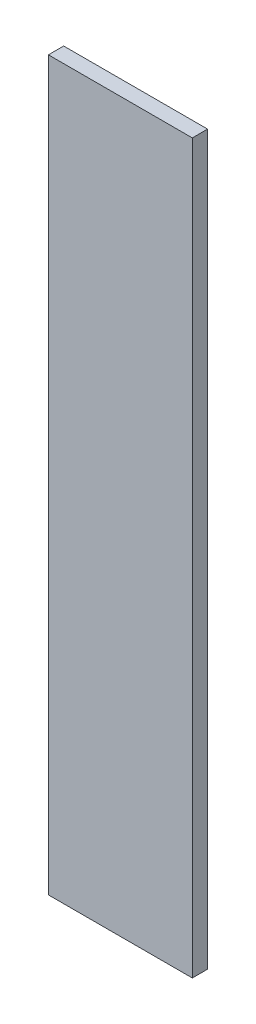
ISO-10303-21;
HEADER;
FILE_DESCRIPTION(('STEP AP214'),'2;1');
FILE_NAME('part.step','',(''),(''),'','','');
FILE_SCHEMA(('AUTOMOTIVE_DESIGN { 1 0 10303 214 1 1 1 1 }'));
ENDSEC;
DATA;
#1=APPLICATION_CONTEXT('core data for automotive mechanical design processes');
#2=APPLICATION_PROTOCOL_DEFINITION('international standard','automotive_design',2000,#1);
#3=PRODUCT_CONTEXT('',#1,'mechanical');
#4=PRODUCT('Part','Part','',(#3));
#5=PRODUCT_RELATED_PRODUCT_CATEGORY('part','',(#4));
#6=PRODUCT_DEFINITION_FORMATION('','',#4);
#7=PRODUCT_DEFINITION_CONTEXT('part definition',#1,'design');
#8=PRODUCT_DEFINITION('design','',#6,#7);
#9=PRODUCT_DEFINITION_SHAPE('','',#8);
#10=(LENGTH_UNIT() NAMED_UNIT(*) SI_UNIT(.MILLI.,.METRE.));
#11=(NAMED_UNIT(*) PLANE_ANGLE_UNIT() SI_UNIT($,.RADIAN.));
#12=(NAMED_UNIT(*) SI_UNIT($,.STERADIAN.) SOLID_ANGLE_UNIT());
#13=UNCERTAINTY_MEASURE_WITH_UNIT(LENGTH_MEASURE(1.E-05),#10,'distance_accuracy_value','');
#14=(GEOMETRIC_REPRESENTATION_CONTEXT(3) GLOBAL_UNCERTAINTY_ASSIGNED_CONTEXT((#13)) GLOBAL_UNIT_ASSIGNED_CONTEXT((#10,
#11,#12)) REPRESENTATION_CONTEXT('',''));
#15=CARTESIAN_POINT('',(0.,0.,0.));
#16=DIRECTION('',(0.,0.,1.));
#17=DIRECTION('',(1.,0.,0.));
#18=AXIS2_PLACEMENT_3D('',#15,#16,#17);
#19=CARTESIAN_POINT('',(-72.182208841127,0.,3.));
#20=DIRECTION('',(0.,1.,0.));
#21=DIRECTION('',(0.,0.,1.));
#22=AXIS2_PLACEMENT_3D('',#19,#20,#21);
#23=PLANE('',#22);
#24=DIRECTION('',(1.,0.,0.));
#25=VECTOR('',#24,1.);
#26=CARTESIAN_POINT('',(-72.182208841127,0.,0.));
#27=LINE('',#26,#25);
#28=CARTESIAN_POINT('',(-100.466480088589,0.,0.));
#29=VERTEX_POINT('',#28);
#30=CARTESIAN_POINT('',(-72.182208841127,0.,0.));
#31=VERTEX_POINT('',#30);
#32=EDGE_CURVE('E97',#29,#31,#27,.T.);
#33=ORIENTED_EDGE('',*,*,#32,.T.);
#34=DIRECTION('',(0.,0.,-1.));
#35=VECTOR('',#34,1.);
#36=CARTESIAN_POINT('',(-72.182208841127,0.,3.));
#37=LINE('',#36,#35);
#38=CARTESIAN_POINT('',(-72.182208841127,0.,3.));
#39=VERTEX_POINT('',#38);
#40=EDGE_CURVE('E11',#39,#31,#37,.T.);
#41=ORIENTED_EDGE('',*,*,#40,.F.);
#42=DIRECTION('',(1.,0.,0.));
#43=VECTOR('',#42,1.);
#44=CARTESIAN_POINT('',(-72.182208841127,0.,3.));
#45=LINE('',#44,#43);
#46=CARTESIAN_POINT('',(-100.466480088589,0.,3.));
#47=VERTEX_POINT('',#46);
#48=EDGE_CURVE('E83',#47,#39,#45,.T.);
#49=ORIENTED_EDGE('',*,*,#48,.F.);
#50=DIRECTION('',(0.,0.,-1.));
#51=VECTOR('',#50,1.);
#52=CARTESIAN_POINT('',(-100.466480088589,0.,3.));
#53=LINE('',#52,#51);
#54=EDGE_CURVE('E93',#47,#29,#53,.T.);
#55=ORIENTED_EDGE('',*,*,#54,.T.);
#56=EDGE_LOOP('',(#33,#41,#49,#55));
#57=FACE_BOUND('',#56,.T.);
#58=ADVANCED_FACE('F33',(#57),#23,.F.);
#59=CARTESIAN_POINT('',(-72.182208841127,143.,3.));
#60=DIRECTION('',(-1.,0.,0.));
#61=DIRECTION('',(0.,-1.,0.));
#62=AXIS2_PLACEMENT_3D('',#59,#60,#61);
#63=PLANE('',#62);
#64=DIRECTION('',(0.,1.,0.));
#65=VECTOR('',#64,1.);
#66=CARTESIAN_POINT('',(-72.182208841127,143.,0.));
#67=LINE('',#66,#65);
#68=CARTESIAN_POINT('',(-72.182208841127,143.,0.));
#69=VERTEX_POINT('',#68);
#70=EDGE_CURVE('E88',#31,#69,#67,.T.);
#71=ORIENTED_EDGE('',*,*,#70,.T.);
#72=DIRECTION('',(0.,0.,-1.));
#73=VECTOR('',#72,1.);
#74=CARTESIAN_POINT('',(-72.182208841127,143.,3.));
#75=LINE('',#74,#73);
#76=CARTESIAN_POINT('',(-72.182208841127,143.,3.));
#77=VERTEX_POINT('',#76);
#78=EDGE_CURVE('E41',#77,#69,#75,.T.);
#79=ORIENTED_EDGE('',*,*,#78,.F.);
#80=DIRECTION('',(0.,1.,0.));
#81=VECTOR('',#80,1.);
#82=CARTESIAN_POINT('',(-72.182208841127,143.,3.));
#83=LINE('',#82,#81);
#84=EDGE_CURVE('E77',#39,#77,#83,.T.);
#85=ORIENTED_EDGE('',*,*,#84,.F.);
#86=ORIENTED_EDGE('',*,*,#40,.T.);
#87=EDGE_LOOP('',(#71,#79,#85,#86));
#88=FACE_BOUND('',#87,.T.);
#89=ADVANCED_FACE('F87',(#88),#63,.F.);
#90=CARTESIAN_POINT('',(-100.466480088589,143.,3.));
#91=DIRECTION('',(0.,-1.,0.));
#92=DIRECTION('',(0.,0.,-1.));
#93=AXIS2_PLACEMENT_3D('',#90,#91,#92);
#94=PLANE('',#93);
#95=DIRECTION('',(-1.,0.,0.));
#96=VECTOR('',#95,1.);
#97=CARTESIAN_POINT('',(-100.466480088589,143.,0.));
#98=LINE('',#97,#96);
#99=CARTESIAN_POINT('',(-100.466480088589,143.,0.));
#100=VERTEX_POINT('',#99);
#101=EDGE_CURVE('E101',#69,#100,#98,.T.);
#102=ORIENTED_EDGE('',*,*,#101,.T.);
#103=DIRECTION('',(0.,0.,-1.));
#104=VECTOR('',#103,1.);
#105=CARTESIAN_POINT('',(-100.466480088589,143.,3.));
#106=LINE('',#105,#104);
#107=CARTESIAN_POINT('',(-100.466480088589,143.,3.));
#108=VERTEX_POINT('',#107);
#109=EDGE_CURVE('E90',#108,#100,#106,.T.);
#110=ORIENTED_EDGE('',*,*,#109,.F.);
#111=DIRECTION('',(-1.,0.,0.));
#112=VECTOR('',#111,1.);
#113=CARTESIAN_POINT('',(-100.466480088589,143.,3.));
#114=LINE('',#113,#112);
#115=EDGE_CURVE('E80',#77,#108,#114,.T.);
#116=ORIENTED_EDGE('',*,*,#115,.F.);
#117=ORIENTED_EDGE('',*,*,#78,.T.);
#118=EDGE_LOOP('',(#102,#110,#116,#117));
#119=FACE_BOUND('',#118,.T.);
#120=ADVANCED_FACE('F91',(#119),#94,.F.);
#121=CARTESIAN_POINT('',(-100.466480088589,0.,3.));
#122=DIRECTION('',(1.,0.,0.));
#123=DIRECTION('',(0.,0.,-1.));
#124=AXIS2_PLACEMENT_3D('',#121,#122,#123);
#125=PLANE('',#124);
#126=DIRECTION('',(0.,-1.,0.));
#127=VECTOR('',#126,1.);
#128=CARTESIAN_POINT('',(-100.466480088589,0.,0.));
#129=LINE('',#128,#127);
#130=EDGE_CURVE('E66',#100,#29,#129,.T.);
#131=ORIENTED_EDGE('',*,*,#130,.T.);
#132=ORIENTED_EDGE('',*,*,#54,.F.);
#133=DIRECTION('',(0.,-1.,0.));
#134=VECTOR('',#133,1.);
#135=CARTESIAN_POINT('',(-100.466480088589,140.,3.));
#136=LINE('',#135,#134);
#137=EDGE_CURVE('E49',#108,#47,#136,.T.);
#138=ORIENTED_EDGE('',*,*,#137,.F.);
#139=ORIENTED_EDGE('',*,*,#109,.T.);
#140=EDGE_LOOP('',(#131,#132,#138,#139));
#141=FACE_BOUND('',#140,.T.);
#142=ADVANCED_FACE('F105',(#141),#125,.F.);
#143=CARTESIAN_POINT('',(0.,0.,3.));
#144=DIRECTION('',(0.,0.,-1.));
#145=DIRECTION('',(-1.,0.,0.));
#146=AXIS2_PLACEMENT_3D('',#143,#144,#145);
#147=PLANE('',#146);
#148=ORIENTED_EDGE('',*,*,#48,.T.);
#149=ORIENTED_EDGE('',*,*,#84,.T.);
#150=ORIENTED_EDGE('',*,*,#115,.T.);
#151=ORIENTED_EDGE('',*,*,#137,.T.);
#152=EDGE_LOOP('',(#148,#149,#150,#151));
#153=FACE_BOUND('',#152,.T.);
#154=ADVANCED_FACE('F78',(#153),#147,.F.);
#155=CARTESIAN_POINT('',(0.,0.,0.));
#156=DIRECTION('',(0.,0.,-1.));
#157=DIRECTION('',(-1.,0.,0.));
#158=AXIS2_PLACEMENT_3D('',#155,#156,#157);
#159=PLANE('',#158);
#160=ORIENTED_EDGE('',*,*,#32,.F.);
#161=ORIENTED_EDGE('',*,*,#130,.F.);
#162=ORIENTED_EDGE('',*,*,#101,.F.);
#163=ORIENTED_EDGE('',*,*,#70,.F.);
#164=EDGE_LOOP('',(#160,#161,#162,#163));
#165=FACE_BOUND('',#164,.T.);
#166=ADVANCED_FACE('F107',(#165),#159,.T.);
#167=CLOSED_SHELL('',(#58,#89,#120,#142,#154,#166));
#168=MANIFOLD_SOLID_BREP('B2',#167);
#169=ADVANCED_BREP_SHAPE_REPRESENTATION('',(#18,#168),#14);
#170=SHAPE_DEFINITION_REPRESENTATION(#9,#169);
ENDSEC;
END-ISO-10303-21;
